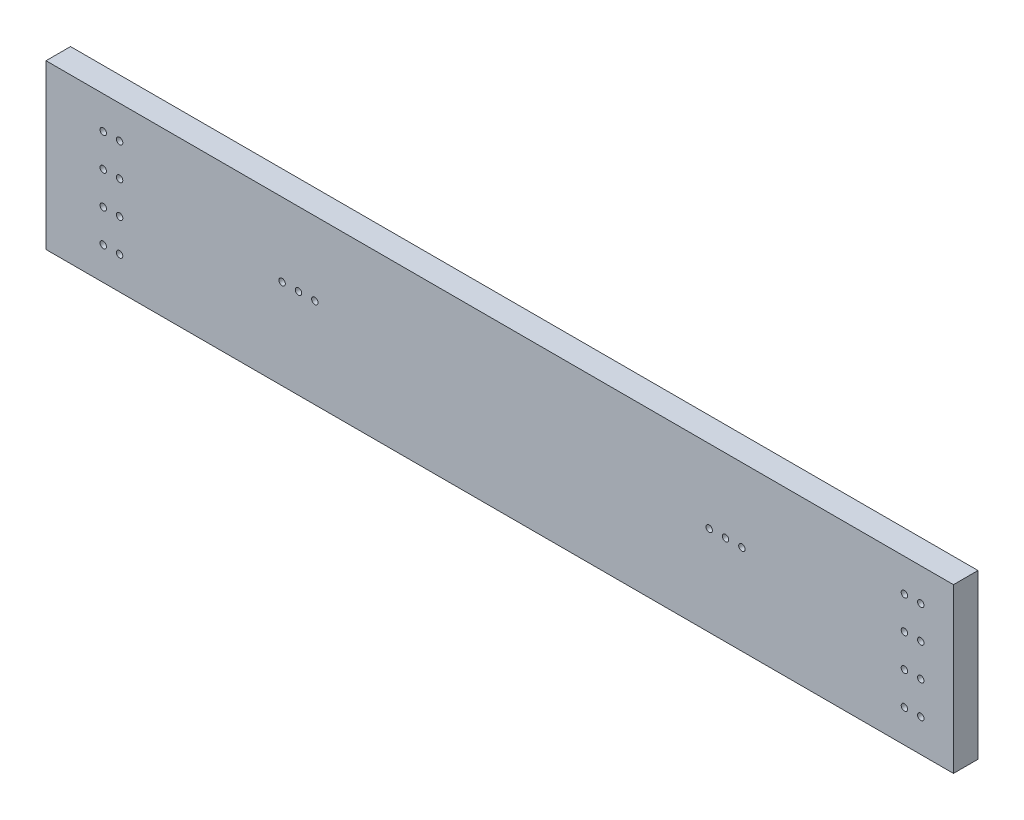
ISO-10303-21;
HEADER;
FILE_DESCRIPTION(('STEP AP214'),'2;1');
FILE_NAME('part.step','',(''),(''),'','','');
FILE_SCHEMA(('AUTOMOTIVE_DESIGN { 1 0 10303 214 1 1 1 1 }'));
ENDSEC;
DATA;
#1=APPLICATION_CONTEXT('core data for automotive mechanical design processes');
#2=APPLICATION_PROTOCOL_DEFINITION('international standard','automotive_design',2000,#1);
#3=PRODUCT_CONTEXT('',#1,'mechanical');
#4=PRODUCT('Part','Part','',(#3));
#5=PRODUCT_RELATED_PRODUCT_CATEGORY('part','',(#4));
#6=PRODUCT_DEFINITION_FORMATION('','',#4);
#7=PRODUCT_DEFINITION_CONTEXT('part definition',#1,'design');
#8=PRODUCT_DEFINITION('design','',#6,#7);
#9=PRODUCT_DEFINITION_SHAPE('','',#8);
#10=(LENGTH_UNIT() NAMED_UNIT(*) SI_UNIT(.MILLI.,.METRE.));
#11=(NAMED_UNIT(*) PLANE_ANGLE_UNIT() SI_UNIT($,.RADIAN.));
#12=(NAMED_UNIT(*) SI_UNIT($,.STERADIAN.) SOLID_ANGLE_UNIT());
#13=UNCERTAINTY_MEASURE_WITH_UNIT(LENGTH_MEASURE(1.E-05),#10,'distance_accuracy_value','');
#14=(GEOMETRIC_REPRESENTATION_CONTEXT(3) GLOBAL_UNCERTAINTY_ASSIGNED_CONTEXT((#13)) GLOBAL_UNIT_ASSIGNED_CONTEXT((#10,
#11,#12)) REPRESENTATION_CONTEXT('',''));
#15=CARTESIAN_POINT('',(0.,0.,0.));
#16=DIRECTION('',(0.,0.,1.));
#17=DIRECTION('',(1.,0.,0.));
#18=AXIS2_PLACEMENT_3D('',#15,#16,#17);
#19=CARTESIAN_POINT('',(-400009.525,774.957385438528,31.750000000045));
#20=DIRECTION('',(0.,0.,-1.));
#21=DIRECTION('',(-1.,0.,0.));
#22=AXIS2_PLACEMENT_3D('',#19,#20,#21);
#23=PLANE('',#22);
#24=CARTESIAN_POINT('',(-317.499999999983,-6.35000000000002,31.7499999999978));
#25=DIRECTION('',(0.,0.,1.));
#26=DIRECTION('',(1.,0.,0.));
#27=AXIS2_PLACEMENT_3D('',#24,#25,#26);
#28=CIRCLE('',#27,2.49554999999999);
#29=CARTESIAN_POINT('',(-315.004449999983,-6.35000000000002,31.7499999999978));
#30=VERTEX_POINT('',#29);
#31=EDGE_CURVE('E195',#30,#30,#28,.T.);
#32=ORIENTED_EDGE('',*,*,#31,.F.);
#33=EDGE_LOOP('',(#32));
#34=FACE_BOUND('',#33,.T.);
#35=CARTESIAN_POINT('',(-304.799999999983,-31.75,31.7499999999978));
#36=DIRECTION('',(0.,0.,1.));
#37=DIRECTION('',(1.,0.,0.));
#38=AXIS2_PLACEMENT_3D('',#35,#36,#37);
#39=CIRCLE('',#38,2.49554999999999);
#40=CARTESIAN_POINT('',(-302.304449999983,-31.75,31.7499999999978));
#41=VERTEX_POINT('',#40);
#42=EDGE_CURVE('E188',#41,#41,#39,.T.);
#43=ORIENTED_EDGE('',*,*,#42,.F.);
#44=EDGE_LOOP('',(#43));
#45=FACE_BOUND('',#44,.T.);
#46=CARTESIAN_POINT('',(-317.499999999983,-31.75,31.7499999999978));
#47=DIRECTION('',(0.,0.,1.));
#48=DIRECTION('',(1.,0.,0.));
#49=AXIS2_PLACEMENT_3D('',#46,#47,#48);
#50=CIRCLE('',#49,2.49554999999999);
#51=CARTESIAN_POINT('',(-315.004449999983,-31.75,31.7499999999978));
#52=VERTEX_POINT('',#51);
#53=EDGE_CURVE('E205',#52,#52,#50,.T.);
#54=ORIENTED_EDGE('',*,*,#53,.F.);
#55=EDGE_LOOP('',(#54));
#56=FACE_BOUND('',#55,.T.);
#57=CARTESIAN_POINT('',(-178.562,12.7,31.7499999999978));
#58=DIRECTION('',(0.,0.,1.));
#59=DIRECTION('',(1.,0.,0.));
#60=AXIS2_PLACEMENT_3D('',#57,#58,#59);
#61=CIRCLE('',#60,2.4892);
#62=CARTESIAN_POINT('',(-176.0728,12.7,31.7499999999978));
#63=VERTEX_POINT('',#62);
#64=EDGE_CURVE('E139',#63,#63,#61,.T.);
#65=ORIENTED_EDGE('',*,*,#64,.F.);
#66=EDGE_LOOP('',(#65));
#67=FACE_BOUND('',#66,.T.);
#68=CARTESIAN_POINT('',(-317.499999999984,44.45,31.7499999999978));
#69=DIRECTION('',(0.,0.,1.));
#70=DIRECTION('',(1.,0.,0.));
#71=AXIS2_PLACEMENT_3D('',#68,#69,#70);
#72=CIRCLE('',#71,2.49554999999999);
#73=CARTESIAN_POINT('',(-315.004449999984,44.45,31.7499999999978));
#74=VERTEX_POINT('',#73);
#75=EDGE_CURVE('E171',#74,#74,#72,.T.);
#76=ORIENTED_EDGE('',*,*,#75,.F.);
#77=EDGE_LOOP('',(#76));
#78=FACE_BOUND('',#77,.T.);
#79=CARTESIAN_POINT('',(-304.799999999984,19.05,31.7499999999978));
#80=DIRECTION('',(0.,0.,1.));
#81=DIRECTION('',(1.,0.,0.));
#82=AXIS2_PLACEMENT_3D('',#79,#80,#81);
#83=CIRCLE('',#82,2.49554999999999);
#84=CARTESIAN_POINT('',(-302.304449999984,19.05,31.7499999999978));
#85=VERTEX_POINT('',#84);
#86=EDGE_CURVE('E164',#85,#85,#83,.T.);
#87=ORIENTED_EDGE('',*,*,#86,.F.);
#88=EDGE_LOOP('',(#87));
#89=FACE_BOUND('',#88,.T.);
#90=CARTESIAN_POINT('',(-317.499999999984,19.05,31.7499999999978));
#91=DIRECTION('',(0.,0.,1.));
#92=DIRECTION('',(1.,0.,0.));
#93=AXIS2_PLACEMENT_3D('',#90,#91,#92);
#94=CIRCLE('',#93,2.49554999999999);
#95=CARTESIAN_POINT('',(-315.004449999984,19.05,31.7499999999978));
#96=VERTEX_POINT('',#95);
#97=EDGE_CURVE('E183',#96,#96,#94,.T.);
#98=ORIENTED_EDGE('',*,*,#97,.F.);
#99=EDGE_LOOP('',(#98));
#100=FACE_BOUND('',#99,.T.);
#101=CARTESIAN_POINT('',(-304.799999999983,-6.35000000000002,31.7499999999978));
#102=DIRECTION('',(0.,0.,1.));
#103=DIRECTION('',(1.,0.,0.));
#104=AXIS2_PLACEMENT_3D('',#101,#102,#103);
#105=CIRCLE('',#104,2.49554999999999);
#106=CARTESIAN_POINT('',(-302.304449999983,-6.35000000000002,31.7499999999978));
#107=VERTEX_POINT('',#106);
#108=EDGE_CURVE('E176',#107,#107,#105,.T.);
#109=ORIENTED_EDGE('',*,*,#108,.F.);
#110=EDGE_LOOP('',(#109));
#111=FACE_BOUND('',#110,.T.);
#112=CARTESIAN_POINT('',(304.799999999987,-31.7499999999999,31.7499999999978));
#113=DIRECTION('',(0.,0.,1.));
#114=DIRECTION('',(-1.,0.,0.));
#115=AXIS2_PLACEMENT_3D('',#112,#113,#114);
#116=CIRCLE('',#115,2.49554999999999);
#117=CARTESIAN_POINT('',(302.304449999987,-31.7499999999999,31.7499999999978));
#118=VERTEX_POINT('',#117);
#119=EDGE_CURVE('E147',#118,#118,#116,.T.);
#120=ORIENTED_EDGE('',*,*,#119,.F.);
#121=EDGE_LOOP('',(#120));
#122=FACE_BOUND('',#121,.T.);
#123=CARTESIAN_POINT('',(304.799999999986,44.4500000000001,31.7499999999978));
#124=DIRECTION('',(0.,0.,1.));
#125=DIRECTION('',(-1.,0.,0.));
#126=AXIS2_PLACEMENT_3D('',#123,#124,#125);
#127=CIRCLE('',#126,2.49554999999999);
#128=CARTESIAN_POINT('',(302.304449999986,44.4500000000001,31.7499999999978));
#129=VERTEX_POINT('',#128);
#130=EDGE_CURVE('E140',#129,#129,#127,.T.);
#131=ORIENTED_EDGE('',*,*,#130,.F.);
#132=EDGE_LOOP('',(#131));
#133=FACE_BOUND('',#132,.T.);
#134=CARTESIAN_POINT('',(317.499999999986,44.4500000000001,31.7499999999978));
#135=DIRECTION('',(0.,0.,1.));
#136=DIRECTION('',(-1.,0.,0.));
#137=AXIS2_PLACEMENT_3D('',#134,#135,#136);
#138=CIRCLE('',#137,2.49554999999999);
#139=CARTESIAN_POINT('',(315.004449999986,44.4500000000001,31.7499999999978));
#140=VERTEX_POINT('',#139);
#141=EDGE_CURVE('E159',#140,#140,#138,.T.);
#142=ORIENTED_EDGE('',*,*,#141,.F.);
#143=EDGE_LOOP('',(#142));
#144=FACE_BOUND('',#143,.T.);
#145=CARTESIAN_POINT('',(-165.862,12.7,31.7499999999978));
#146=DIRECTION('',(0.,0.,1.));
#147=DIRECTION('',(1.,0.,0.));
#148=AXIS2_PLACEMENT_3D('',#145,#146,#147);
#149=CIRCLE('',#148,2.4892);
#150=CARTESIAN_POINT('',(-163.3728,12.7,31.7499999999978));
#151=VERTEX_POINT('',#150);
#152=EDGE_CURVE('E152',#151,#151,#149,.T.);
#153=ORIENTED_EDGE('',*,*,#152,.F.);
#154=EDGE_LOOP('',(#153));
#155=FACE_BOUND('',#154,.T.);
#156=CARTESIAN_POINT('',(317.499999999987,-6.34999999999989,31.7499999999978));
#157=DIRECTION('',(0.,0.,1.));
#158=DIRECTION('',(-1.,0.,0.));
#159=AXIS2_PLACEMENT_3D('',#156,#157,#158);
#160=CIRCLE('',#159,2.49554999999999);
#161=CARTESIAN_POINT('',(315.004449999987,-6.34999999999989,31.7499999999978));
#162=VERTEX_POINT('',#161);
#163=EDGE_CURVE('E114',#162,#162,#160,.T.);
#164=ORIENTED_EDGE('',*,*,#163,.F.);
#165=EDGE_LOOP('',(#164));
#166=FACE_BOUND('',#165,.T.);
#167=CARTESIAN_POINT('',(304.799999999987,-6.34999999999988,31.7499999999978));
#168=DIRECTION('',(0.,0.,1.));
#169=DIRECTION('',(-1.,0.,0.));
#170=AXIS2_PLACEMENT_3D('',#167,#168,#169);
#171=CIRCLE('',#170,2.49554999999999);
#172=CARTESIAN_POINT('',(302.304449999987,-6.34999999999988,31.7499999999978));
#173=VERTEX_POINT('',#172);
#174=EDGE_CURVE('E121',#173,#173,#171,.T.);
#175=ORIENTED_EDGE('',*,*,#174,.F.);
#176=EDGE_LOOP('',(#175));
#177=FACE_BOUND('',#176,.T.);
#178=CARTESIAN_POINT('',(317.499999999986,19.0500000000001,31.7499999999978));
#179=DIRECTION('',(0.,0.,1.));
#180=DIRECTION('',(-1.,0.,0.));
#181=AXIS2_PLACEMENT_3D('',#178,#179,#180);
#182=CIRCLE('',#181,2.49554999999999);
#183=CARTESIAN_POINT('',(315.004449999986,19.0500000000001,31.7499999999978));
#184=VERTEX_POINT('',#183);
#185=EDGE_CURVE('E127',#184,#184,#182,.T.);
#186=ORIENTED_EDGE('',*,*,#185,.F.);
#187=EDGE_LOOP('',(#186));
#188=FACE_BOUND('',#187,.T.);
#189=CARTESIAN_POINT('',(304.799999999986,19.0500000000001,31.7499999999978));
#190=DIRECTION('',(0.,0.,1.));
#191=DIRECTION('',(-1.,0.,0.));
#192=AXIS2_PLACEMENT_3D('',#189,#190,#191);
#193=CIRCLE('',#192,2.49554999999999);
#194=CARTESIAN_POINT('',(302.304449999986,19.0500000000001,31.7499999999978));
#195=VERTEX_POINT('',#194);
#196=EDGE_CURVE('E133',#195,#195,#193,.T.);
#197=ORIENTED_EDGE('',*,*,#196,.F.);
#198=EDGE_LOOP('',(#197));
#199=FACE_BOUND('',#198,.T.);
#200=CARTESIAN_POINT('',(-153.162,12.7,31.7499999999978));
#201=DIRECTION('',(0.,0.,1.));
#202=DIRECTION('',(1.,0.,0.));
#203=AXIS2_PLACEMENT_3D('',#200,#201,#202);
#204=CIRCLE('',#203,2.4892);
#205=CARTESIAN_POINT('',(-150.6728,12.7,31.7499999999978));
#206=VERTEX_POINT('',#205);
#207=EDGE_CURVE('E234',#206,#206,#204,.T.);
#208=ORIENTED_EDGE('',*,*,#207,.F.);
#209=EDGE_LOOP('',(#208));
#210=FACE_BOUND('',#209,.T.);
#211=CARTESIAN_POINT('',(153.162,12.7,31.7499999999978));
#212=DIRECTION('',(0.,0.,1.));
#213=DIRECTION('',(1.,0.,0.));
#214=AXIS2_PLACEMENT_3D('',#211,#212,#213);
#215=CIRCLE('',#214,2.4892);
#216=CARTESIAN_POINT('',(155.6512,12.7,31.7499999999978));
#217=VERTEX_POINT('',#216);
#218=EDGE_CURVE('E228',#217,#217,#215,.T.);
#219=ORIENTED_EDGE('',*,*,#218,.F.);
#220=EDGE_LOOP('',(#219));
#221=FACE_BOUND('',#220,.T.);
#222=CARTESIAN_POINT('',(165.862,12.7,31.7499999999978));
#223=DIRECTION('',(0.,0.,1.));
#224=DIRECTION('',(1.,0.,0.));
#225=AXIS2_PLACEMENT_3D('',#222,#223,#224);
#226=CIRCLE('',#225,2.4892);
#227=CARTESIAN_POINT('',(168.3512,12.7,31.7499999999978));
#228=VERTEX_POINT('',#227);
#229=EDGE_CURVE('E222',#228,#228,#226,.T.);
#230=ORIENTED_EDGE('',*,*,#229,.F.);
#231=EDGE_LOOP('',(#230));
#232=FACE_BOUND('',#231,.T.);
#233=CARTESIAN_POINT('',(178.562,12.7,31.7499999999978));
#234=DIRECTION('',(0.,0.,1.));
#235=DIRECTION('',(1.,0.,0.));
#236=AXIS2_PLACEMENT_3D('',#233,#234,#235);
#237=CIRCLE('',#236,2.4892);
#238=CARTESIAN_POINT('',(181.0512,12.7,31.7499999999978));
#239=VERTEX_POINT('',#238);
#240=EDGE_CURVE('E216',#239,#239,#237,.T.);
#241=ORIENTED_EDGE('',*,*,#240,.F.);
#242=EDGE_LOOP('',(#241));
#243=FACE_BOUND('',#242,.T.);
#244=CARTESIAN_POINT('',(317.499999999987,-31.7499999999999,31.7499999999978));
#245=DIRECTION('',(0.,0.,1.));
#246=DIRECTION('',(-1.,0.,0.));
#247=AXIS2_PLACEMENT_3D('',#244,#245,#246);
#248=CIRCLE('',#247,2.49554999999999);
#249=CARTESIAN_POINT('',(315.004449999987,-31.7499999999999,31.7499999999978));
#250=VERTEX_POINT('',#249);
#251=EDGE_CURVE('E210',#250,#250,#248,.T.);
#252=ORIENTED_EDGE('',*,*,#251,.F.);
#253=EDGE_LOOP('',(#252));
#254=FACE_BOUND('',#253,.T.);
#255=CARTESIAN_POINT('',(-304.799999999984,44.45,31.7499999999978));
#256=DIRECTION('',(0.,0.,1.));
#257=DIRECTION('',(1.,0.,0.));
#258=AXIS2_PLACEMENT_3D('',#255,#256,#257);
#259=CIRCLE('',#258,2.49554999999999);
#260=CARTESIAN_POINT('',(-302.304449999984,44.45,31.7499999999978));
#261=VERTEX_POINT('',#260);
#262=EDGE_CURVE('E108',#261,#261,#259,.T.);
#263=ORIENTED_EDGE('',*,*,#262,.F.);
#264=EDGE_LOOP('',(#263));
#265=FACE_BOUND('',#264,.T.);
#266=DIRECTION('',(1.,0.,0.));
#267=VECTOR('',#266,1.);
#268=CARTESIAN_POINT('',(-400009.525,69.85,31.750000000045));
#269=LINE('',#268,#267);
#270=CARTESIAN_POINT('',(-361.949999999984,69.85,31.7499999999882));
#271=VERTEX_POINT('',#270);
#272=CARTESIAN_POINT('',(342.899999999986,69.85,31.7499999999882));
#273=VERTEX_POINT('',#272);
#274=EDGE_CURVE('E84',#271,#273,#269,.T.);
#275=ORIENTED_EDGE('',*,*,#274,.F.);
#276=DIRECTION('',(0.,-1.,0.));
#277=VECTOR('',#276,1.);
#278=CARTESIAN_POINT('',(-361.949999999984,774.957385438528,31.7499999999882));
#279=LINE('',#278,#277);
#280=CARTESIAN_POINT('',(-361.949999999984,-57.15,31.7499999999882));
#281=VERTEX_POINT('',#280);
#282=EDGE_CURVE('E38',#271,#281,#279,.T.);
#283=ORIENTED_EDGE('',*,*,#282,.T.);
#284=DIRECTION('',(1.,0.,0.));
#285=VECTOR('',#284,1.);
#286=CARTESIAN_POINT('',(-400009.525,-57.15,31.750000000045));
#287=LINE('',#286,#285);
#288=CARTESIAN_POINT('',(342.899999999986,-57.15,31.7499999999882));
#289=VERTEX_POINT('',#288);
#290=EDGE_CURVE('E82',#281,#289,#287,.T.);
#291=ORIENTED_EDGE('',*,*,#290,.T.);
#292=DIRECTION('',(0.,-1.,0.));
#293=VECTOR('',#292,1.);
#294=CARTESIAN_POINT('',(342.899999999986,774.957385438528,31.7499999999882));
#295=LINE('',#294,#293);
#296=EDGE_CURVE('E73',#273,#289,#295,.T.);
#297=ORIENTED_EDGE('',*,*,#296,.F.);
#298=EDGE_LOOP('',(#275,#283,#291,#297));
#299=FACE_BOUND('',#298,.T.);
#300=ADVANCED_FACE('F34',(#34,#45,#56,#67,#78,#89,#100,#111,#122,#133,#144,#155,#166,#177,#188,
#199,#210,#221,#232,#243,#254,#265,#299),#23,.F.);
#301=CARTESIAN_POINT('',(342.899999999986,774.957385438528,290905.31));
#302=DIRECTION('',(-1.,0.,0.));
#303=DIRECTION('',(0.,0.,1.));
#304=AXIS2_PLACEMENT_3D('',#301,#302,#303);
#305=PLANE('',#304);
#306=DIRECTION('',(0.,0.,-1.));
#307=VECTOR('',#306,1.);
#308=CARTESIAN_POINT('',(342.899999999986,69.85,290905.31));
#309=LINE('',#308,#307);
#310=CARTESIAN_POINT('',(342.899999999986,69.85,12.7000000000028));
#311=VERTEX_POINT('',#310);
#312=EDGE_CURVE('E43',#273,#311,#309,.T.);
#313=ORIENTED_EDGE('',*,*,#312,.F.);
#314=ORIENTED_EDGE('',*,*,#296,.T.);
#315=DIRECTION('',(0.,0.,-1.));
#316=VECTOR('',#315,1.);
#317=CARTESIAN_POINT('',(342.899999999986,-57.15,290905.31));
#318=LINE('',#317,#316);
#319=CARTESIAN_POINT('',(342.899999999986,-57.15,12.7000000000028));
#320=VERTEX_POINT('',#319);
#321=EDGE_CURVE('E95',#289,#320,#318,.T.);
#322=ORIENTED_EDGE('',*,*,#321,.T.);
#323=DIRECTION('',(0.,-1.,0.));
#324=VECTOR('',#323,1.);
#325=CARTESIAN_POINT('',(342.899999999986,774.957385438528,12.7000000000028));
#326=LINE('',#325,#324);
#327=EDGE_CURVE('E104',#311,#320,#326,.T.);
#328=ORIENTED_EDGE('',*,*,#327,.F.);
#329=EDGE_LOOP('',(#313,#314,#322,#328));
#330=FACE_BOUND('',#329,.T.);
#331=ADVANCED_FACE('F253',(#330),#305,.F.);
#332=CARTESIAN_POINT('',(-400009.525,774.957385438528,12.7000000000521));
#333=DIRECTION('',(0.,0.,1.));
#334=DIRECTION('',(1.,0.,0.));
#335=AXIS2_PLACEMENT_3D('',#332,#333,#334);
#336=PLANE('',#335);
#337=CARTESIAN_POINT('',(-317.499999999983,-6.35000000000002,12.6999999999953));
#338=DIRECTION('',(0.,0.,1.));
#339=DIRECTION('',(1.,0.,0.));
#340=AXIS2_PLACEMENT_3D('',#337,#338,#339);
#341=CIRCLE('',#340,2.49554999999999);
#342=CARTESIAN_POINT('',(-315.004449999983,-6.35000000000002,12.6999999999953));
#343=VERTEX_POINT('',#342);
#344=EDGE_CURVE('E180',#343,#343,#341,.T.);
#345=ORIENTED_EDGE('',*,*,#344,.T.);
#346=EDGE_LOOP('',(#345));
#347=FACE_BOUND('',#346,.T.);
#348=CARTESIAN_POINT('',(-304.799999999983,-31.75,12.6999999999953));
#349=DIRECTION('',(0.,0.,1.));
#350=DIRECTION('',(1.,0.,0.));
#351=AXIS2_PLACEMENT_3D('',#348,#349,#350);
#352=CIRCLE('',#351,2.49554999999999);
#353=CARTESIAN_POINT('',(-302.304449999983,-31.75,12.6999999999953));
#354=VERTEX_POINT('',#353);
#355=EDGE_CURVE('E191',#354,#354,#352,.T.);
#356=ORIENTED_EDGE('',*,*,#355,.T.);
#357=EDGE_LOOP('',(#356));
#358=FACE_BOUND('',#357,.T.);
#359=CARTESIAN_POINT('',(-317.499999999983,-31.75,12.6999999999953));
#360=DIRECTION('',(0.,0.,1.));
#361=DIRECTION('',(1.,0.,0.));
#362=AXIS2_PLACEMENT_3D('',#359,#360,#361);
#363=CIRCLE('',#362,2.49554999999999);
#364=CARTESIAN_POINT('',(-315.004449999983,-31.75,12.6999999999953));
#365=VERTEX_POINT('',#364);
#366=EDGE_CURVE('E192',#365,#365,#363,.T.);
#367=ORIENTED_EDGE('',*,*,#366,.T.);
#368=EDGE_LOOP('',(#367));
#369=FACE_BOUND('',#368,.T.);
#370=CARTESIAN_POINT('',(-178.562,12.7,12.6999999999953));
#371=DIRECTION('',(0.,0.,1.));
#372=DIRECTION('',(1.,0.,0.));
#373=AXIS2_PLACEMENT_3D('',#370,#371,#372);
#374=CIRCLE('',#373,2.4892);
#375=CARTESIAN_POINT('',(-176.0728,12.7,12.6999999999953));
#376=VERTEX_POINT('',#375);
#377=EDGE_CURVE('E202',#376,#376,#374,.T.);
#378=ORIENTED_EDGE('',*,*,#377,.T.);
#379=EDGE_LOOP('',(#378));
#380=FACE_BOUND('',#379,.T.);
#381=CARTESIAN_POINT('',(-317.499999999984,44.45,12.6999999999953));
#382=DIRECTION('',(0.,0.,1.));
#383=DIRECTION('',(1.,0.,0.));
#384=AXIS2_PLACEMENT_3D('',#381,#382,#383);
#385=CIRCLE('',#384,2.49554999999999);
#386=CARTESIAN_POINT('',(-315.004449999984,44.45,12.6999999999953));
#387=VERTEX_POINT('',#386);
#388=EDGE_CURVE('E111',#387,#387,#385,.T.);
#389=ORIENTED_EDGE('',*,*,#388,.T.);
#390=EDGE_LOOP('',(#389));
#391=FACE_BOUND('',#390,.T.);
#392=CARTESIAN_POINT('',(-304.799999999984,19.05,12.6999999999953));
#393=DIRECTION('',(0.,0.,1.));
#394=DIRECTION('',(1.,0.,0.));
#395=AXIS2_PLACEMENT_3D('',#392,#393,#394);
#396=CIRCLE('',#395,2.49554999999999);
#397=CARTESIAN_POINT('',(-302.304449999984,19.05,12.6999999999953));
#398=VERTEX_POINT('',#397);
#399=EDGE_CURVE('E167',#398,#398,#396,.T.);
#400=ORIENTED_EDGE('',*,*,#399,.T.);
#401=EDGE_LOOP('',(#400));
#402=FACE_BOUND('',#401,.T.);
#403=CARTESIAN_POINT('',(-317.499999999984,19.05,12.6999999999953));
#404=DIRECTION('',(0.,0.,1.));
#405=DIRECTION('',(1.,0.,0.));
#406=AXIS2_PLACEMENT_3D('',#403,#404,#405);
#407=CIRCLE('',#406,2.49554999999999);
#408=CARTESIAN_POINT('',(-315.004449999984,19.05,12.6999999999953));
#409=VERTEX_POINT('',#408);
#410=EDGE_CURVE('E168',#409,#409,#407,.T.);
#411=ORIENTED_EDGE('',*,*,#410,.T.);
#412=EDGE_LOOP('',(#411));
#413=FACE_BOUND('',#412,.T.);
#414=CARTESIAN_POINT('',(-304.799999999983,-6.35000000000002,12.6999999999953));
#415=DIRECTION('',(0.,0.,1.));
#416=DIRECTION('',(1.,0.,0.));
#417=AXIS2_PLACEMENT_3D('',#414,#415,#416);
#418=CIRCLE('',#417,2.49554999999999);
#419=CARTESIAN_POINT('',(-302.304449999983,-6.35000000000002,12.6999999999953));
#420=VERTEX_POINT('',#419);
#421=EDGE_CURVE('E179',#420,#420,#418,.T.);
#422=ORIENTED_EDGE('',*,*,#421,.T.);
#423=EDGE_LOOP('',(#422));
#424=FACE_BOUND('',#423,.T.);
#425=CARTESIAN_POINT('',(304.799999999987,-31.7499999999999,12.6999999999953));
#426=DIRECTION('',(0.,0.,1.));
#427=DIRECTION('',(-1.,0.,0.));
#428=AXIS2_PLACEMENT_3D('',#425,#426,#427);
#429=CIRCLE('',#428,2.49554999999999);
#430=CARTESIAN_POINT('',(302.304449999987,-31.7499999999999,12.6999999999953));
#431=VERTEX_POINT('',#430);
#432=EDGE_CURVE('E118',#431,#431,#429,.T.);
#433=ORIENTED_EDGE('',*,*,#432,.T.);
#434=EDGE_LOOP('',(#433));
#435=FACE_BOUND('',#434,.T.);
#436=CARTESIAN_POINT('',(304.799999999986,44.4500000000001,12.6999999999953));
#437=DIRECTION('',(0.,0.,1.));
#438=DIRECTION('',(-1.,0.,0.));
#439=AXIS2_PLACEMENT_3D('',#436,#437,#438);
#440=CIRCLE('',#439,2.49554999999999);
#441=CARTESIAN_POINT('',(302.304449999986,44.4500000000001,12.6999999999953));
#442=VERTEX_POINT('',#441);
#443=EDGE_CURVE('E143',#442,#442,#440,.T.);
#444=ORIENTED_EDGE('',*,*,#443,.T.);
#445=EDGE_LOOP('',(#444));
#446=FACE_BOUND('',#445,.T.);
#447=CARTESIAN_POINT('',(317.499999999986,44.4500000000001,12.6999999999953));
#448=DIRECTION('',(0.,0.,1.));
#449=DIRECTION('',(-1.,0.,0.));
#450=AXIS2_PLACEMENT_3D('',#447,#448,#449);
#451=CIRCLE('',#450,2.49554999999999);
#452=CARTESIAN_POINT('',(315.004449999986,44.4500000000001,12.6999999999953));
#453=VERTEX_POINT('',#452);
#454=EDGE_CURVE('E144',#453,#453,#451,.T.);
#455=ORIENTED_EDGE('',*,*,#454,.T.);
#456=EDGE_LOOP('',(#455));
#457=FACE_BOUND('',#456,.T.);
#458=CARTESIAN_POINT('',(-165.862,12.7,12.6999999999953));
#459=DIRECTION('',(0.,0.,1.));
#460=DIRECTION('',(1.,0.,0.));
#461=AXIS2_PLACEMENT_3D('',#458,#459,#460);
#462=CIRCLE('',#461,2.4892);
#463=CARTESIAN_POINT('',(-163.3728,12.7,12.6999999999953));
#464=VERTEX_POINT('',#463);
#465=EDGE_CURVE('E155',#464,#464,#462,.T.);
#466=ORIENTED_EDGE('',*,*,#465,.T.);
#467=EDGE_LOOP('',(#466));
#468=FACE_BOUND('',#467,.T.);
#469=CARTESIAN_POINT('',(317.499999999987,-6.34999999999989,12.6999999999953));
#470=DIRECTION('',(0.,0.,1.));
#471=DIRECTION('',(-1.,0.,0.));
#472=AXIS2_PLACEMENT_3D('',#469,#470,#471);
#473=CIRCLE('',#472,2.49554999999999);
#474=CARTESIAN_POINT('',(315.004449999987,-6.34999999999989,12.6999999999953));
#475=VERTEX_POINT('',#474);
#476=EDGE_CURVE('E117',#475,#475,#473,.T.);
#477=ORIENTED_EDGE('',*,*,#476,.T.);
#478=EDGE_LOOP('',(#477));
#479=FACE_BOUND('',#478,.T.);
#480=CARTESIAN_POINT('',(304.799999999987,-6.34999999999988,12.6999999999953));
#481=DIRECTION('',(0.,0.,1.));
#482=DIRECTION('',(-1.,0.,0.));
#483=AXIS2_PLACEMENT_3D('',#480,#481,#482);
#484=CIRCLE('',#483,2.49554999999999);
#485=CARTESIAN_POINT('',(302.304449999987,-6.34999999999988,12.6999999999953));
#486=VERTEX_POINT('',#485);
#487=EDGE_CURVE('E124',#486,#486,#484,.T.);
#488=ORIENTED_EDGE('',*,*,#487,.T.);
#489=EDGE_LOOP('',(#488));
#490=FACE_BOUND('',#489,.T.);
#491=CARTESIAN_POINT('',(317.499999999986,19.0500000000001,12.6999999999953));
#492=DIRECTION('',(0.,0.,1.));
#493=DIRECTION('',(-1.,0.,0.));
#494=AXIS2_PLACEMENT_3D('',#491,#492,#493);
#495=CIRCLE('',#494,2.49554999999999);
#496=CARTESIAN_POINT('',(315.004449999986,19.0500000000001,12.6999999999953));
#497=VERTEX_POINT('',#496);
#498=EDGE_CURVE('E130',#497,#497,#495,.T.);
#499=ORIENTED_EDGE('',*,*,#498,.T.);
#500=EDGE_LOOP('',(#499));
#501=FACE_BOUND('',#500,.T.);
#502=CARTESIAN_POINT('',(304.799999999986,19.0500000000001,12.6999999999953));
#503=DIRECTION('',(0.,0.,1.));
#504=DIRECTION('',(-1.,0.,0.));
#505=AXIS2_PLACEMENT_3D('',#502,#503,#504);
#506=CIRCLE('',#505,2.49554999999999);
#507=CARTESIAN_POINT('',(302.304449999986,19.0500000000001,12.6999999999953));
#508=VERTEX_POINT('',#507);
#509=EDGE_CURVE('E136',#508,#508,#506,.T.);
#510=ORIENTED_EDGE('',*,*,#509,.T.);
#511=EDGE_LOOP('',(#510));
#512=FACE_BOUND('',#511,.T.);
#513=CARTESIAN_POINT('',(-153.162,12.7,12.6999999999953));
#514=DIRECTION('',(0.,0.,1.));
#515=DIRECTION('',(1.,0.,0.));
#516=AXIS2_PLACEMENT_3D('',#513,#514,#515);
#517=CIRCLE('',#516,2.4892);
#518=CARTESIAN_POINT('',(-150.6728,12.7,12.6999999999953));
#519=VERTEX_POINT('',#518);
#520=EDGE_CURVE('E156',#519,#519,#517,.T.);
#521=ORIENTED_EDGE('',*,*,#520,.T.);
#522=EDGE_LOOP('',(#521));
#523=FACE_BOUND('',#522,.T.);
#524=CARTESIAN_POINT('',(153.162,12.7,12.6999999999953));
#525=DIRECTION('',(0.,0.,1.));
#526=DIRECTION('',(1.,0.,0.));
#527=AXIS2_PLACEMENT_3D('',#524,#525,#526);
#528=CIRCLE('',#527,2.4892);
#529=CARTESIAN_POINT('',(155.6512,12.7,12.6999999999953));
#530=VERTEX_POINT('',#529);
#531=EDGE_CURVE('E231',#530,#530,#528,.T.);
#532=ORIENTED_EDGE('',*,*,#531,.T.);
#533=EDGE_LOOP('',(#532));
#534=FACE_BOUND('',#533,.T.);
#535=CARTESIAN_POINT('',(165.862,12.7,12.6999999999953));
#536=DIRECTION('',(0.,0.,1.));
#537=DIRECTION('',(1.,0.,0.));
#538=AXIS2_PLACEMENT_3D('',#535,#536,#537);
#539=CIRCLE('',#538,2.4892);
#540=CARTESIAN_POINT('',(168.3512,12.7,12.6999999999953));
#541=VERTEX_POINT('',#540);
#542=EDGE_CURVE('E225',#541,#541,#539,.T.);
#543=ORIENTED_EDGE('',*,*,#542,.T.);
#544=EDGE_LOOP('',(#543));
#545=FACE_BOUND('',#544,.T.);
#546=CARTESIAN_POINT('',(178.562,12.7,12.6999999999953));
#547=DIRECTION('',(0.,0.,1.));
#548=DIRECTION('',(1.,0.,0.));
#549=AXIS2_PLACEMENT_3D('',#546,#547,#548);
#550=CIRCLE('',#549,2.4892);
#551=CARTESIAN_POINT('',(181.0512,12.7,12.6999999999953));
#552=VERTEX_POINT('',#551);
#553=EDGE_CURVE('E219',#552,#552,#550,.T.);
#554=ORIENTED_EDGE('',*,*,#553,.T.);
#555=EDGE_LOOP('',(#554));
#556=FACE_BOUND('',#555,.T.);
#557=CARTESIAN_POINT('',(317.499999999987,-31.7499999999999,12.6999999999953));
#558=DIRECTION('',(0.,0.,1.));
#559=DIRECTION('',(-1.,0.,0.));
#560=AXIS2_PLACEMENT_3D('',#557,#558,#559);
#561=CIRCLE('',#560,2.49554999999999);
#562=CARTESIAN_POINT('',(315.004449999987,-31.7499999999999,12.6999999999953));
#563=VERTEX_POINT('',#562);
#564=EDGE_CURVE('E213',#563,#563,#561,.T.);
#565=ORIENTED_EDGE('',*,*,#564,.T.);
#566=EDGE_LOOP('',(#565));
#567=FACE_BOUND('',#566,.T.);
#568=CARTESIAN_POINT('',(-304.799999999984,44.45,12.6999999999953));
#569=DIRECTION('',(0.,0.,1.));
#570=DIRECTION('',(1.,0.,0.));
#571=AXIS2_PLACEMENT_3D('',#568,#569,#570);
#572=CIRCLE('',#571,2.49554999999999);
#573=CARTESIAN_POINT('',(-302.304449999984,44.45,12.6999999999953));
#574=VERTEX_POINT('',#573);
#575=EDGE_CURVE('E86',#574,#574,#572,.T.);
#576=ORIENTED_EDGE('',*,*,#575,.T.);
#577=EDGE_LOOP('',(#576));
#578=FACE_BOUND('',#577,.T.);
#579=DIRECTION('',(-1.,0.,0.));
#580=VECTOR('',#579,1.);
#581=CARTESIAN_POINT('',(-400009.525,69.85,12.7000000000521));
#582=LINE('',#581,#580);
#583=CARTESIAN_POINT('',(-361.949999999984,69.85,12.6999999999953));
#584=VERTEX_POINT('',#583);
#585=EDGE_CURVE('E11',#311,#584,#582,.T.);
#586=ORIENTED_EDGE('',*,*,#585,.F.);
#587=ORIENTED_EDGE('',*,*,#327,.T.);
#588=DIRECTION('',(-1.,0.,0.));
#589=VECTOR('',#588,1.);
#590=CARTESIAN_POINT('',(-400009.525,-57.15,12.7000000000521));
#591=LINE('',#590,#589);
#592=CARTESIAN_POINT('',(-361.949999999984,-57.15,12.6999999999953));
#593=VERTEX_POINT('',#592);
#594=EDGE_CURVE('E105',#320,#593,#591,.T.);
#595=ORIENTED_EDGE('',*,*,#594,.T.);
#596=DIRECTION('',(0.,-1.,0.));
#597=VECTOR('',#596,1.);
#598=CARTESIAN_POINT('',(-361.949999999984,774.957385438528,12.6999999999953));
#599=LINE('',#598,#597);
#600=EDGE_CURVE('E56',#584,#593,#599,.T.);
#601=ORIENTED_EDGE('',*,*,#600,.F.);
#602=EDGE_LOOP('',(#586,#587,#595,#601));
#603=FACE_BOUND('',#602,.T.);
#604=ADVANCED_FACE('F240',(#347,#358,#369,#380,#391,#402,#413,#424,#435,#446,#457,#468,#479,
#490,#501,#512,#523,#534,#545,#556,#567,#578,#603),#336,.F.);
#605=CARTESIAN_POINT('',(-361.950000000832,774.957385438528,290905.310000001));
#606=DIRECTION('',(1.,0.,0.));
#607=DIRECTION('',(0.,0.,-1.));
#608=AXIS2_PLACEMENT_3D('',#605,#606,#607);
#609=PLANE('',#608);
#610=DIRECTION('',(0.,0.,1.));
#611=VECTOR('',#610,1.);
#612=CARTESIAN_POINT('',(-361.950000000832,69.85,290905.310000001));
#613=LINE('',#612,#611);
#614=EDGE_CURVE('E92',#584,#271,#613,.T.);
#615=ORIENTED_EDGE('',*,*,#614,.F.);
#616=ORIENTED_EDGE('',*,*,#600,.T.);
#617=DIRECTION('',(0.,0.,1.));
#618=VECTOR('',#617,1.);
#619=CARTESIAN_POINT('',(-361.950000000832,-57.15,290905.310000001));
#620=LINE('',#619,#618);
#621=EDGE_CURVE('E88',#593,#281,#620,.T.);
#622=ORIENTED_EDGE('',*,*,#621,.T.);
#623=ORIENTED_EDGE('',*,*,#282,.F.);
#624=EDGE_LOOP('',(#615,#616,#622,#623));
#625=FACE_BOUND('',#624,.T.);
#626=ADVANCED_FACE('F89',(#625),#609,.F.);
#627=CARTESIAN_POINT('',(0.,-57.15,0.));
#628=DIRECTION('',(0.,1.,0.));
#629=DIRECTION('',(0.,0.,1.));
#630=AXIS2_PLACEMENT_3D('',#627,#628,#629);
#631=PLANE('',#630);
#632=ORIENTED_EDGE('',*,*,#290,.F.);
#633=ORIENTED_EDGE('',*,*,#621,.F.);
#634=ORIENTED_EDGE('',*,*,#594,.F.);
#635=ORIENTED_EDGE('',*,*,#321,.F.);
#636=EDGE_LOOP('',(#632,#633,#634,#635));
#637=FACE_BOUND('',#636,.T.);
#638=ADVANCED_FACE('F94',(#637),#631,.F.);
#639=CARTESIAN_POINT('',(0.,69.85,0.));
#640=DIRECTION('',(0.,1.,0.));
#641=DIRECTION('',(0.,0.,1.));
#642=AXIS2_PLACEMENT_3D('',#639,#640,#641);
#643=PLANE('',#642);
#644=ORIENTED_EDGE('',*,*,#614,.T.);
#645=ORIENTED_EDGE('',*,*,#274,.T.);
#646=ORIENTED_EDGE('',*,*,#312,.T.);
#647=ORIENTED_EDGE('',*,*,#585,.T.);
#648=EDGE_LOOP('',(#644,#645,#646,#647));
#649=FACE_BOUND('',#648,.T.);
#650=ADVANCED_FACE('F36',(#649),#643,.T.);
#651=CARTESIAN_POINT('',(-304.799999999984,44.45,12.6999999999953));
#652=DIRECTION('',(0.,0.,1.));
#653=DIRECTION('',(1.,0.,0.));
#654=AXIS2_PLACEMENT_3D('',#651,#652,#653);
#655=CYLINDRICAL_SURFACE('',#654,2.49554999999999);
#656=ORIENTED_EDGE('',*,*,#575,.F.);
#657=EDGE_LOOP('',(#656));
#658=FACE_BOUND('',#657,.T.);
#659=ORIENTED_EDGE('',*,*,#262,.T.);
#660=EDGE_LOOP('',(#659));
#661=FACE_BOUND('',#660,.T.);
#662=ADVANCED_FACE('F265',(#658,#661),#655,.F.);
#663=CARTESIAN_POINT('',(317.499999999987,-31.7499999999999,12.6999999999953));
#664=DIRECTION('',(0.,0.,1.));
#665=DIRECTION('',(1.,0.,0.));
#666=AXIS2_PLACEMENT_3D('',#663,#664,#665);
#667=CYLINDRICAL_SURFACE('',#666,2.49554999999999);
#668=ORIENTED_EDGE('',*,*,#564,.F.);
#669=EDGE_LOOP('',(#668));
#670=FACE_BOUND('',#669,.T.);
#671=ORIENTED_EDGE('',*,*,#251,.T.);
#672=EDGE_LOOP('',(#671));
#673=FACE_BOUND('',#672,.T.);
#674=ADVANCED_FACE('F267',(#670,#673),#667,.F.);
#675=CARTESIAN_POINT('',(178.562,12.7,12.6999999999953));
#676=DIRECTION('',(0.,0.,1.));
#677=DIRECTION('',(1.,0.,0.));
#678=AXIS2_PLACEMENT_3D('',#675,#676,#677);
#679=CYLINDRICAL_SURFACE('',#678,2.4892);
#680=ORIENTED_EDGE('',*,*,#553,.F.);
#681=EDGE_LOOP('',(#680));
#682=FACE_BOUND('',#681,.T.);
#683=ORIENTED_EDGE('',*,*,#240,.T.);
#684=EDGE_LOOP('',(#683));
#685=FACE_BOUND('',#684,.T.);
#686=ADVANCED_FACE('F274',(#682,#685),#679,.F.);
#687=CARTESIAN_POINT('',(165.862,12.7,12.6999999999953));
#688=DIRECTION('',(0.,0.,1.));
#689=DIRECTION('',(1.,0.,0.));
#690=AXIS2_PLACEMENT_3D('',#687,#688,#689);
#691=CYLINDRICAL_SURFACE('',#690,2.4892);
#692=ORIENTED_EDGE('',*,*,#542,.F.);
#693=EDGE_LOOP('',(#692));
#694=FACE_BOUND('',#693,.T.);
#695=ORIENTED_EDGE('',*,*,#229,.T.);
#696=EDGE_LOOP('',(#695));
#697=FACE_BOUND('',#696,.T.);
#698=ADVANCED_FACE('F342',(#694,#697),#691,.F.);
#699=CARTESIAN_POINT('',(153.162,12.7,12.6999999999953));
#700=DIRECTION('',(0.,0.,1.));
#701=DIRECTION('',(1.,0.,0.));
#702=AXIS2_PLACEMENT_3D('',#699,#700,#701);
#703=CYLINDRICAL_SURFACE('',#702,2.4892);
#704=ORIENTED_EDGE('',*,*,#531,.F.);
#705=EDGE_LOOP('',(#704));
#706=FACE_BOUND('',#705,.T.);
#707=ORIENTED_EDGE('',*,*,#218,.T.);
#708=EDGE_LOOP('',(#707));
#709=FACE_BOUND('',#708,.T.);
#710=ADVANCED_FACE('F247',(#706,#709),#703,.F.);
#711=CARTESIAN_POINT('',(-153.162,12.7,12.6999999999953));
#712=DIRECTION('',(0.,0.,1.));
#713=DIRECTION('',(1.,0.,0.));
#714=AXIS2_PLACEMENT_3D('',#711,#712,#713);
#715=CYLINDRICAL_SURFACE('',#714,2.4892);
#716=ORIENTED_EDGE('',*,*,#520,.F.);
#717=EDGE_LOOP('',(#716));
#718=FACE_BOUND('',#717,.T.);
#719=ORIENTED_EDGE('',*,*,#207,.T.);
#720=EDGE_LOOP('',(#719));
#721=FACE_BOUND('',#720,.T.);
#722=ADVANCED_FACE('F243',(#718,#721),#715,.F.);
#723=CARTESIAN_POINT('',(304.799999999986,19.0500000000001,12.6999999999953));
#724=DIRECTION('',(0.,0.,1.));
#725=DIRECTION('',(1.,0.,0.));
#726=AXIS2_PLACEMENT_3D('',#723,#724,#725);
#727=CYLINDRICAL_SURFACE('',#726,2.49554999999999);
#728=ORIENTED_EDGE('',*,*,#509,.F.);
#729=EDGE_LOOP('',(#728));
#730=FACE_BOUND('',#729,.T.);
#731=ORIENTED_EDGE('',*,*,#196,.T.);
#732=EDGE_LOOP('',(#731));
#733=FACE_BOUND('',#732,.T.);
#734=ADVANCED_FACE('F246',(#730,#733),#727,.F.);
#735=CARTESIAN_POINT('',(317.499999999986,19.0500000000001,12.6999999999953));
#736=DIRECTION('',(0.,0.,1.));
#737=DIRECTION('',(1.,0.,0.));
#738=AXIS2_PLACEMENT_3D('',#735,#736,#737);
#739=CYLINDRICAL_SURFACE('',#738,2.49554999999999);
#740=ORIENTED_EDGE('',*,*,#498,.F.);
#741=EDGE_LOOP('',(#740));
#742=FACE_BOUND('',#741,.T.);
#743=ORIENTED_EDGE('',*,*,#185,.T.);
#744=EDGE_LOOP('',(#743));
#745=FACE_BOUND('',#744,.T.);
#746=ADVANCED_FACE('F372',(#742,#745),#739,.F.);
#747=CARTESIAN_POINT('',(304.799999999987,-6.34999999999988,12.6999999999953));
#748=DIRECTION('',(0.,0.,1.));
#749=DIRECTION('',(1.,0.,0.));
#750=AXIS2_PLACEMENT_3D('',#747,#748,#749);
#751=CYLINDRICAL_SURFACE('',#750,2.49554999999999);
#752=ORIENTED_EDGE('',*,*,#487,.F.);
#753=EDGE_LOOP('',(#752));
#754=FACE_BOUND('',#753,.T.);
#755=ORIENTED_EDGE('',*,*,#174,.T.);
#756=EDGE_LOOP('',(#755));
#757=FACE_BOUND('',#756,.T.);
#758=ADVANCED_FACE('F381',(#754,#757),#751,.F.);
#759=CARTESIAN_POINT('',(317.499999999987,-6.34999999999989,12.6999999999953));
#760=DIRECTION('',(0.,0.,1.));
#761=DIRECTION('',(1.,0.,0.));
#762=AXIS2_PLACEMENT_3D('',#759,#760,#761);
#763=CYLINDRICAL_SURFACE('',#762,2.49554999999999);
#764=ORIENTED_EDGE('',*,*,#476,.F.);
#765=EDGE_LOOP('',(#764));
#766=FACE_BOUND('',#765,.T.);
#767=ORIENTED_EDGE('',*,*,#163,.T.);
#768=EDGE_LOOP('',(#767));
#769=FACE_BOUND('',#768,.T.);
#770=ADVANCED_FACE('F281',(#766,#769),#763,.F.);
#771=CARTESIAN_POINT('',(-165.862,12.7,12.6999999999953));
#772=DIRECTION('',(0.,0.,1.));
#773=DIRECTION('',(1.,0.,0.));
#774=AXIS2_PLACEMENT_3D('',#771,#772,#773);
#775=CYLINDRICAL_SURFACE('',#774,2.4892);
#776=ORIENTED_EDGE('',*,*,#465,.F.);
#777=EDGE_LOOP('',(#776));
#778=FACE_BOUND('',#777,.T.);
#779=ORIENTED_EDGE('',*,*,#152,.T.);
#780=EDGE_LOOP('',(#779));
#781=FACE_BOUND('',#780,.T.);
#782=ADVANCED_FACE('F397',(#778,#781),#775,.F.);
#783=CARTESIAN_POINT('',(317.499999999986,44.4500000000001,12.6999999999953));
#784=DIRECTION('',(0.,0.,1.));
#785=DIRECTION('',(1.,0.,0.));
#786=AXIS2_PLACEMENT_3D('',#783,#784,#785);
#787=CYLINDRICAL_SURFACE('',#786,2.49554999999999);
#788=ORIENTED_EDGE('',*,*,#454,.F.);
#789=EDGE_LOOP('',(#788));
#790=FACE_BOUND('',#789,.T.);
#791=ORIENTED_EDGE('',*,*,#141,.T.);
#792=EDGE_LOOP('',(#791));
#793=FACE_BOUND('',#792,.T.);
#794=ADVANCED_FACE('F405',(#790,#793),#787,.F.);
#795=CARTESIAN_POINT('',(304.799999999986,44.4500000000001,12.6999999999953));
#796=DIRECTION('',(0.,0.,1.));
#797=DIRECTION('',(1.,0.,0.));
#798=AXIS2_PLACEMENT_3D('',#795,#796,#797);
#799=CYLINDRICAL_SURFACE('',#798,2.49554999999999);
#800=ORIENTED_EDGE('',*,*,#443,.F.);
#801=EDGE_LOOP('',(#800));
#802=FACE_BOUND('',#801,.T.);
#803=ORIENTED_EDGE('',*,*,#130,.T.);
#804=EDGE_LOOP('',(#803));
#805=FACE_BOUND('',#804,.T.);
#806=ADVANCED_FACE('F414',(#802,#805),#799,.F.);
#807=CARTESIAN_POINT('',(304.799999999987,-31.7499999999999,12.6999999999953));
#808=DIRECTION('',(0.,0.,1.));
#809=DIRECTION('',(1.,0.,0.));
#810=AXIS2_PLACEMENT_3D('',#807,#808,#809);
#811=CYLINDRICAL_SURFACE('',#810,2.49554999999999);
#812=ORIENTED_EDGE('',*,*,#432,.F.);
#813=EDGE_LOOP('',(#812));
#814=FACE_BOUND('',#813,.T.);
#815=ORIENTED_EDGE('',*,*,#119,.T.);
#816=EDGE_LOOP('',(#815));
#817=FACE_BOUND('',#816,.T.);
#818=ADVANCED_FACE('F423',(#814,#817),#811,.F.);
#819=CARTESIAN_POINT('',(-304.799999999983,-6.35000000000002,12.6999999999953));
#820=DIRECTION('',(0.,0.,1.));
#821=DIRECTION('',(1.,0.,0.));
#822=AXIS2_PLACEMENT_3D('',#819,#820,#821);
#823=CYLINDRICAL_SURFACE('',#822,2.49554999999999);
#824=ORIENTED_EDGE('',*,*,#421,.F.);
#825=EDGE_LOOP('',(#824));
#826=FACE_BOUND('',#825,.T.);
#827=ORIENTED_EDGE('',*,*,#108,.T.);
#828=EDGE_LOOP('',(#827));
#829=FACE_BOUND('',#828,.T.);
#830=ADVANCED_FACE('F432',(#826,#829),#823,.F.);
#831=CARTESIAN_POINT('',(-317.499999999984,19.05,12.6999999999953));
#832=DIRECTION('',(0.,0.,1.));
#833=DIRECTION('',(1.,0.,0.));
#834=AXIS2_PLACEMENT_3D('',#831,#832,#833);
#835=CYLINDRICAL_SURFACE('',#834,2.49554999999999);
#836=ORIENTED_EDGE('',*,*,#410,.F.);
#837=EDGE_LOOP('',(#836));
#838=FACE_BOUND('',#837,.T.);
#839=ORIENTED_EDGE('',*,*,#97,.T.);
#840=EDGE_LOOP('',(#839));
#841=FACE_BOUND('',#840,.T.);
#842=ADVANCED_FACE('F441',(#838,#841),#835,.F.);
#843=CARTESIAN_POINT('',(-304.799999999984,19.05,12.6999999999953));
#844=DIRECTION('',(0.,0.,1.));
#845=DIRECTION('',(1.,0.,0.));
#846=AXIS2_PLACEMENT_3D('',#843,#844,#845);
#847=CYLINDRICAL_SURFACE('',#846,2.49554999999999);
#848=ORIENTED_EDGE('',*,*,#399,.F.);
#849=EDGE_LOOP('',(#848));
#850=FACE_BOUND('',#849,.T.);
#851=ORIENTED_EDGE('',*,*,#86,.T.);
#852=EDGE_LOOP('',(#851));
#853=FACE_BOUND('',#852,.T.);
#854=ADVANCED_FACE('F450',(#850,#853),#847,.F.);
#855=CARTESIAN_POINT('',(-317.499999999984,44.45,12.6999999999953));
#856=DIRECTION('',(0.,0.,1.));
#857=DIRECTION('',(1.,0.,0.));
#858=AXIS2_PLACEMENT_3D('',#855,#856,#857);
#859=CYLINDRICAL_SURFACE('',#858,2.49554999999999);
#860=ORIENTED_EDGE('',*,*,#388,.F.);
#861=EDGE_LOOP('',(#860));
#862=FACE_BOUND('',#861,.T.);
#863=ORIENTED_EDGE('',*,*,#75,.T.);
#864=EDGE_LOOP('',(#863));
#865=FACE_BOUND('',#864,.T.);
#866=ADVANCED_FACE('F459',(#862,#865),#859,.F.);
#867=CARTESIAN_POINT('',(-178.562,12.7,12.6999999999953));
#868=DIRECTION('',(0.,0.,1.));
#869=DIRECTION('',(1.,0.,0.));
#870=AXIS2_PLACEMENT_3D('',#867,#868,#869);
#871=CYLINDRICAL_SURFACE('',#870,2.4892);
#872=ORIENTED_EDGE('',*,*,#377,.F.);
#873=EDGE_LOOP('',(#872));
#874=FACE_BOUND('',#873,.T.);
#875=ORIENTED_EDGE('',*,*,#64,.T.);
#876=EDGE_LOOP('',(#875));
#877=FACE_BOUND('',#876,.T.);
#878=ADVANCED_FACE('F468',(#874,#877),#871,.F.);
#879=CARTESIAN_POINT('',(-317.499999999983,-31.75,12.6999999999953));
#880=DIRECTION('',(0.,0.,1.));
#881=DIRECTION('',(1.,0.,0.));
#882=AXIS2_PLACEMENT_3D('',#879,#880,#881);
#883=CYLINDRICAL_SURFACE('',#882,2.49554999999999);
#884=ORIENTED_EDGE('',*,*,#366,.F.);
#885=EDGE_LOOP('',(#884));
#886=FACE_BOUND('',#885,.T.);
#887=ORIENTED_EDGE('',*,*,#53,.T.);
#888=EDGE_LOOP('',(#887));
#889=FACE_BOUND('',#888,.T.);
#890=ADVANCED_FACE('F477',(#886,#889),#883,.F.);
#891=CARTESIAN_POINT('',(-304.799999999983,-31.75,12.6999999999953));
#892=DIRECTION('',(0.,0.,1.));
#893=DIRECTION('',(1.,0.,0.));
#894=AXIS2_PLACEMENT_3D('',#891,#892,#893);
#895=CYLINDRICAL_SURFACE('',#894,2.49554999999999);
#896=ORIENTED_EDGE('',*,*,#355,.F.);
#897=EDGE_LOOP('',(#896));
#898=FACE_BOUND('',#897,.T.);
#899=ORIENTED_EDGE('',*,*,#42,.T.);
#900=EDGE_LOOP('',(#899));
#901=FACE_BOUND('',#900,.T.);
#902=ADVANCED_FACE('F486',(#898,#901),#895,.F.);
#903=CARTESIAN_POINT('',(-317.499999999983,-6.35000000000002,12.6999999999953));
#904=DIRECTION('',(0.,0.,1.));
#905=DIRECTION('',(1.,0.,0.));
#906=AXIS2_PLACEMENT_3D('',#903,#904,#905);
#907=CYLINDRICAL_SURFACE('',#906,2.49554999999999);
#908=ORIENTED_EDGE('',*,*,#344,.F.);
#909=EDGE_LOOP('',(#908));
#910=FACE_BOUND('',#909,.T.);
#911=ORIENTED_EDGE('',*,*,#31,.T.);
#912=EDGE_LOOP('',(#911));
#913=FACE_BOUND('',#912,.T.);
#914=ADVANCED_FACE('F495',(#910,#913),#907,.F.);
#915=CLOSED_SHELL('',(#300,#331,#604,#626,#638,#650,#662,#674,#686,#698,#710,#722,#734,#746,
#758,#770,#782,#794,#806,#818,#830,#842,#854,#866,#878,#890,#902,#914));
#916=MANIFOLD_SOLID_BREP('B2',#915);
#917=ADVANCED_BREP_SHAPE_REPRESENTATION('',(#18,#916),#14);
#918=SHAPE_DEFINITION_REPRESENTATION(#9,#917);
ENDSEC;
END-ISO-10303-21;
